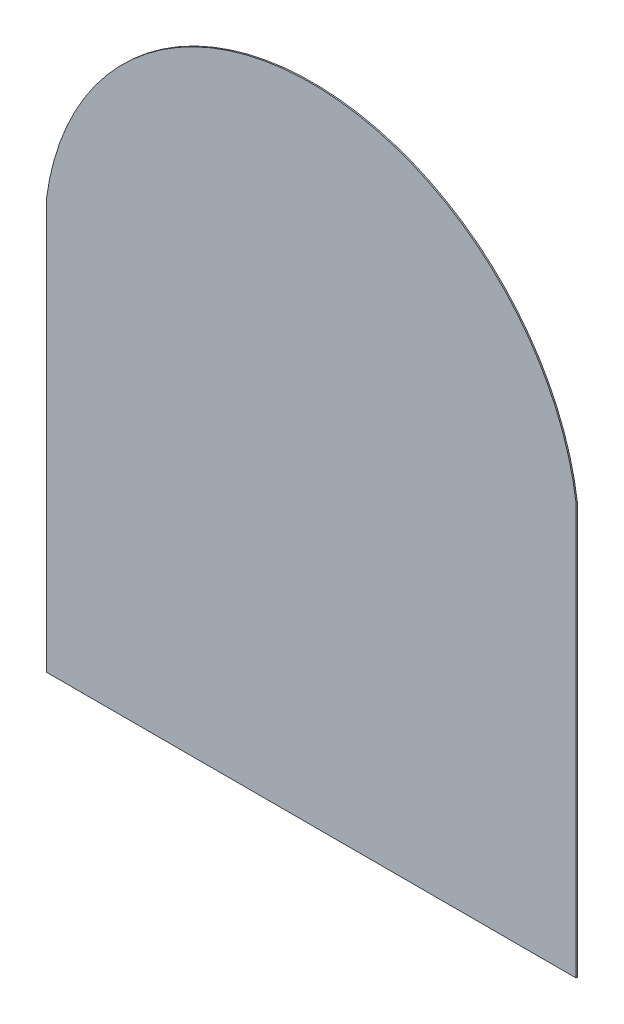
ISO-10303-21;
HEADER;
FILE_DESCRIPTION(('STEP AP214'),'2;1');
FILE_NAME('part.step','',(''),(''),'','','');
FILE_SCHEMA(('AUTOMOTIVE_DESIGN { 1 0 10303 214 1 1 1 1 }'));
ENDSEC;
DATA;
#1=APPLICATION_CONTEXT('core data for automotive mechanical design processes');
#2=APPLICATION_PROTOCOL_DEFINITION('international standard','automotive_design',2000,#1);
#3=PRODUCT_CONTEXT('',#1,'mechanical');
#4=PRODUCT('Part','Part','',(#3));
#5=PRODUCT_RELATED_PRODUCT_CATEGORY('part','',(#4));
#6=PRODUCT_DEFINITION_FORMATION('','',#4);
#7=PRODUCT_DEFINITION_CONTEXT('part definition',#1,'design');
#8=PRODUCT_DEFINITION('design','',#6,#7);
#9=PRODUCT_DEFINITION_SHAPE('','',#8);
#10=(LENGTH_UNIT() NAMED_UNIT(*) SI_UNIT(.MILLI.,.METRE.));
#11=(NAMED_UNIT(*) PLANE_ANGLE_UNIT() SI_UNIT($,.RADIAN.));
#12=(NAMED_UNIT(*) SI_UNIT($,.STERADIAN.) SOLID_ANGLE_UNIT());
#13=UNCERTAINTY_MEASURE_WITH_UNIT(LENGTH_MEASURE(1.E-05),#10,'distance_accuracy_value','');
#14=(GEOMETRIC_REPRESENTATION_CONTEXT(3) GLOBAL_UNCERTAINTY_ASSIGNED_CONTEXT((#13)) GLOBAL_UNIT_ASSIGNED_CONTEXT((#10,
#11,#12)) REPRESENTATION_CONTEXT('',''));
#15=CARTESIAN_POINT('',(0.,0.,0.));
#16=DIRECTION('',(0.,0.,1.));
#17=DIRECTION('',(1.,0.,0.));
#18=AXIS2_PLACEMENT_3D('',#15,#16,#17);
#19=CARTESIAN_POINT('',(-1030.,800.000000000001,2.5));
#20=DIRECTION('',(1.,0.,0.));
#21=DIRECTION('',(0.,0.,-1.));
#22=AXIS2_PLACEMENT_3D('',#19,#20,#21);
#23=PLANE('',#22);
#24=DIRECTION('',(0.,-1.,0.));
#25=VECTOR('',#24,1.);
#26=CARTESIAN_POINT('',(-1030.,800.000000000001,-2.5));
#27=LINE('',#26,#25);
#28=CARTESIAN_POINT('',(-1030.,800.000000000001,-2.5));
#29=VERTEX_POINT('',#28);
#30=CARTESIAN_POINT('',(-1030.,-799.999999999999,-2.5));
#31=VERTEX_POINT('',#30);
#32=EDGE_CURVE('E97',#29,#31,#27,.T.);
#33=ORIENTED_EDGE('',*,*,#32,.T.);
#34=DIRECTION('',(0.,0.,-1.));
#35=VECTOR('',#34,1.);
#36=CARTESIAN_POINT('',(-1030.,-799.999999999999,2.5));
#37=LINE('',#36,#35);
#38=CARTESIAN_POINT('',(-1030.,-799.999999999999,2.5));
#39=VERTEX_POINT('',#38);
#40=EDGE_CURVE('E11',#39,#31,#37,.T.);
#41=ORIENTED_EDGE('',*,*,#40,.F.);
#42=DIRECTION('',(0.,-1.,0.));
#43=VECTOR('',#42,1.);
#44=CARTESIAN_POINT('',(-1030.,800.000000000001,2.5));
#45=LINE('',#44,#43);
#46=CARTESIAN_POINT('',(-1030.,800.000000000001,2.5));
#47=VERTEX_POINT('',#46);
#48=EDGE_CURVE('E85',#47,#39,#45,.T.);
#49=ORIENTED_EDGE('',*,*,#48,.F.);
#50=DIRECTION('',(0.,0.,-1.));
#51=VECTOR('',#50,1.);
#52=CARTESIAN_POINT('',(-1030.,800.000000000001,2.5));
#53=LINE('',#52,#51);
#54=EDGE_CURVE('E93',#47,#29,#53,.T.);
#55=ORIENTED_EDGE('',*,*,#54,.T.);
#56=EDGE_LOOP('',(#33,#41,#49,#55));
#57=FACE_BOUND('',#56,.T.);
#58=ADVANCED_FACE('F34',(#57),#23,.F.);
#59=CARTESIAN_POINT('',(1030.,-799.999999999999,2.5));
#60=DIRECTION('',(0.,1.,0.));
#61=DIRECTION('',(0.,0.,1.));
#62=AXIS2_PLACEMENT_3D('',#59,#60,#61);
#63=PLANE('',#62);
#64=DIRECTION('',(1.,0.,0.));
#65=VECTOR('',#64,1.);
#66=CARTESIAN_POINT('',(1030.,-799.999999999999,-2.5));
#67=LINE('',#66,#65);
#68=CARTESIAN_POINT('',(1030.,-799.999999999999,-2.5));
#69=VERTEX_POINT('',#68);
#70=EDGE_CURVE('E89',#31,#69,#67,.T.);
#71=ORIENTED_EDGE('',*,*,#70,.T.);
#72=DIRECTION('',(0.,0.,-1.));
#73=VECTOR('',#72,1.);
#74=CARTESIAN_POINT('',(1030.,-799.999999999999,2.5));
#75=LINE('',#74,#73);
#76=CARTESIAN_POINT('',(1030.,-799.999999999999,2.5));
#77=VERTEX_POINT('',#76);
#78=EDGE_CURVE('E42',#77,#69,#75,.T.);
#79=ORIENTED_EDGE('',*,*,#78,.F.);
#80=DIRECTION('',(1.,0.,0.));
#81=VECTOR('',#80,1.);
#82=CARTESIAN_POINT('',(1030.,-799.999999999999,2.5));
#83=LINE('',#82,#81);
#84=EDGE_CURVE('E80',#39,#77,#83,.T.);
#85=ORIENTED_EDGE('',*,*,#84,.F.);
#86=ORIENTED_EDGE('',*,*,#40,.T.);
#87=EDGE_LOOP('',(#71,#79,#85,#86));
#88=FACE_BOUND('',#87,.T.);
#89=ADVANCED_FACE('F88',(#88),#63,.F.);
#90=CARTESIAN_POINT('',(1030.,800.000000000001,2.5));
#91=DIRECTION('',(-1.,0.,0.));
#92=DIRECTION('',(0.,-1.,0.));
#93=AXIS2_PLACEMENT_3D('',#90,#91,#92);
#94=PLANE('',#93);
#95=DIRECTION('',(0.,1.,0.));
#96=VECTOR('',#95,1.);
#97=CARTESIAN_POINT('',(1030.,800.000000000001,-2.5));
#98=LINE('',#97,#96);
#99=CARTESIAN_POINT('',(1030.,800.000000000001,-2.5));
#100=VERTEX_POINT('',#99);
#101=EDGE_CURVE('E67',#69,#100,#98,.T.);
#102=ORIENTED_EDGE('',*,*,#101,.T.);
#103=DIRECTION('',(0.,0.,-1.));
#104=VECTOR('',#103,1.);
#105=CARTESIAN_POINT('',(1030.,800.000000000001,2.5));
#106=LINE('',#105,#104);
#107=CARTESIAN_POINT('',(1030.,800.000000000001,2.5));
#108=VERTEX_POINT('',#107);
#109=EDGE_CURVE('E90',#108,#100,#106,.T.);
#110=ORIENTED_EDGE('',*,*,#109,.F.);
#111=DIRECTION('',(0.,1.,0.));
#112=VECTOR('',#111,1.);
#113=CARTESIAN_POINT('',(1030.,800.000000000001,2.5));
#114=LINE('',#113,#112);
#115=EDGE_CURVE('E83',#77,#108,#114,.T.);
#116=ORIENTED_EDGE('',*,*,#115,.F.);
#117=ORIENTED_EDGE('',*,*,#78,.T.);
#118=EDGE_LOOP('',(#102,#110,#116,#117));
#119=FACE_BOUND('',#118,.T.);
#120=ADVANCED_FACE('F91',(#119),#94,.F.);
#121=CARTESIAN_POINT('',(0.,660.611111111113,2.5));
#122=DIRECTION('',(0.,0.,-1.));
#123=DIRECTION('',(-1.,0.,0.));
#124=AXIS2_PLACEMENT_3D('',#121,#122,#123);
#125=CYLINDRICAL_SURFACE('',#124,1039.38888888889);
#126=CARTESIAN_POINT('',(0.,660.611111111113,-2.5));
#127=DIRECTION('',(0.,0.,1.));
#128=DIRECTION('',(-1.,0.,0.));
#129=AXIS2_PLACEMENT_3D('',#126,#127,#128);
#130=CIRCLE('',#129,1039.38888888889);
#131=EDGE_CURVE('E73',#100,#29,#130,.T.);
#132=ORIENTED_EDGE('',*,*,#131,.T.);
#133=ORIENTED_EDGE('',*,*,#54,.F.);
#134=CARTESIAN_POINT('',(0.,660.611111111113,2.5));
#135=DIRECTION('',(0.,0.,1.));
#136=DIRECTION('',(-1.,0.,0.));
#137=AXIS2_PLACEMENT_3D('',#134,#135,#136);
#138=CIRCLE('',#137,1039.38888888889);
#139=EDGE_CURVE('E50',#108,#47,#138,.T.);
#140=ORIENTED_EDGE('',*,*,#139,.F.);
#141=ORIENTED_EDGE('',*,*,#109,.T.);
#142=EDGE_LOOP('',(#132,#133,#140,#141));
#143=FACE_BOUND('',#142,.T.);
#144=ADVANCED_FACE('F104',(#143),#125,.T.);
#145=CARTESIAN_POINT('',(0.,660.611111111113,2.5));
#146=DIRECTION('',(0.,0.,-1.));
#147=DIRECTION('',(-1.,0.,0.));
#148=AXIS2_PLACEMENT_3D('',#145,#146,#147);
#149=PLANE('',#148);
#150=ORIENTED_EDGE('',*,*,#48,.T.);
#151=ORIENTED_EDGE('',*,*,#84,.T.);
#152=ORIENTED_EDGE('',*,*,#115,.T.);
#153=ORIENTED_EDGE('',*,*,#139,.T.);
#154=EDGE_LOOP('',(#150,#151,#152,#153));
#155=FACE_BOUND('',#154,.T.);
#156=ADVANCED_FACE('F81',(#155),#149,.F.);
#157=CARTESIAN_POINT('',(0.,660.611111111113,-2.5));
#158=DIRECTION('',(0.,0.,-1.));
#159=DIRECTION('',(-1.,0.,0.));
#160=AXIS2_PLACEMENT_3D('',#157,#158,#159);
#161=PLANE('',#160);
#162=ORIENTED_EDGE('',*,*,#32,.F.);
#163=ORIENTED_EDGE('',*,*,#131,.F.);
#164=ORIENTED_EDGE('',*,*,#101,.F.);
#165=ORIENTED_EDGE('',*,*,#70,.F.);
#166=EDGE_LOOP('',(#162,#163,#164,#165));
#167=FACE_BOUND('',#166,.T.);
#168=ADVANCED_FACE('F107',(#167),#161,.T.);
#169=CLOSED_SHELL('',(#58,#89,#120,#144,#156,#168));
#170=MANIFOLD_SOLID_BREP('B2',#169);
#171=ADVANCED_BREP_SHAPE_REPRESENTATION('',(#18,#170),#14);
#172=SHAPE_DEFINITION_REPRESENTATION(#9,#171);
ENDSEC;
END-ISO-10303-21;
